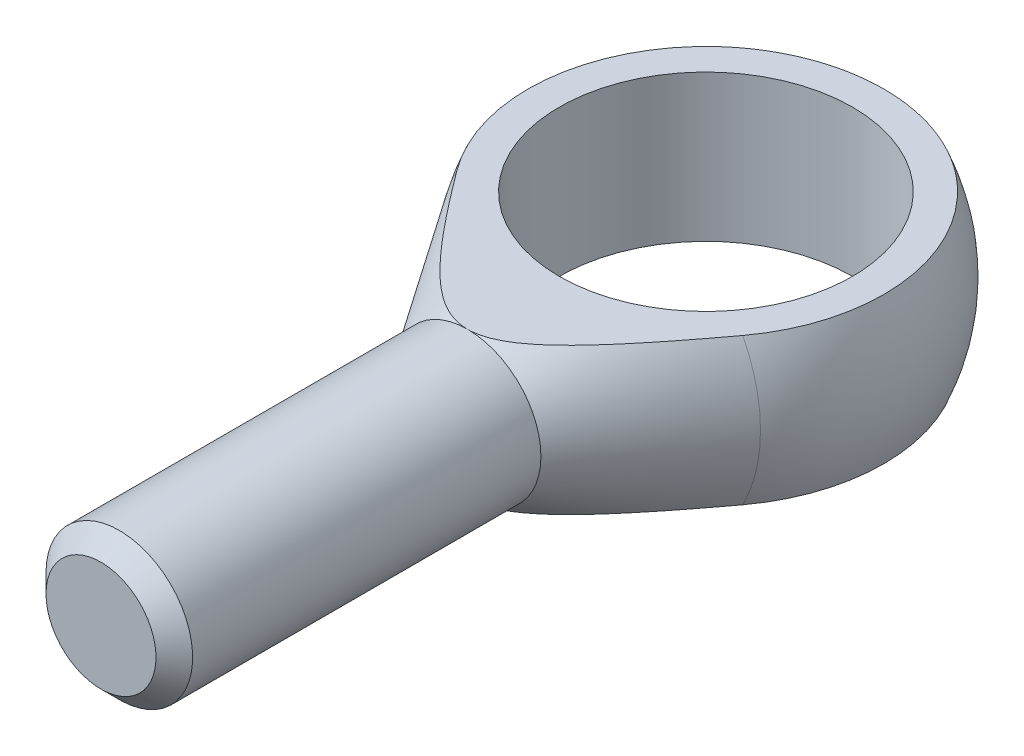
ISO-10303-21;
HEADER;
FILE_DESCRIPTION(('STEP AP214'),'2;1');
FILE_NAME('part.step','',(''),(''),'','','');
FILE_SCHEMA(('AUTOMOTIVE_DESIGN { 1 0 10303 214 1 1 1 1 }'));
ENDSEC;
DATA;
#1=APPLICATION_CONTEXT('core data for automotive mechanical design processes');
#2=APPLICATION_PROTOCOL_DEFINITION('international standard','automotive_design',2000,#1);
#3=PRODUCT_CONTEXT('',#1,'mechanical');
#4=PRODUCT('Part','Part','',(#3));
#5=PRODUCT_RELATED_PRODUCT_CATEGORY('part','',(#4));
#6=PRODUCT_DEFINITION_FORMATION('','',#4);
#7=PRODUCT_DEFINITION_CONTEXT('part definition',#1,'design');
#8=PRODUCT_DEFINITION('design','',#6,#7);
#9=PRODUCT_DEFINITION_SHAPE('','',#8);
#10=(LENGTH_UNIT() NAMED_UNIT(*) SI_UNIT(.MILLI.,.METRE.));
#11=(NAMED_UNIT(*) PLANE_ANGLE_UNIT() SI_UNIT($,.RADIAN.));
#12=(NAMED_UNIT(*) SI_UNIT($,.STERADIAN.) SOLID_ANGLE_UNIT());
#13=UNCERTAINTY_MEASURE_WITH_UNIT(LENGTH_MEASURE(1.E-05),#10,'distance_accuracy_value','');
#14=(GEOMETRIC_REPRESENTATION_CONTEXT(3) GLOBAL_UNCERTAINTY_ASSIGNED_CONTEXT((#13)) GLOBAL_UNIT_ASSIGNED_CONTEXT((#10,
#11,#12)) REPRESENTATION_CONTEXT('',''));
#15=CARTESIAN_POINT('',(0.,0.,0.));
#16=DIRECTION('',(0.,0.,1.));
#17=DIRECTION('',(1.,0.,0.));
#18=AXIS2_PLACEMENT_3D('',#15,#16,#17);
#19=CARTESIAN_POINT('',(0.,0.,26.));
#20=DIRECTION('',(0.,0.,-1.));
#21=DIRECTION('',(-1.,0.,0.));
#22=AXIS2_PLACEMENT_3D('',#19,#20,#21);
#23=CONICAL_SURFACE('',#22,8.,0.583443982313992);
#24=CARTESIAN_POINT('',(0.,0.,11.5689303158746));
#25=DIRECTION('',(0.,0.,-1.));
#26=DIRECTION('',(-1.,0.,0.));
#27=AXIS2_PLACEMENT_3D('',#24,#25,#26);
#28=CIRCLE('',#27,17.5259764734076);
#29=CARTESIAN_POINT('',(-15.5935836595197,-8.,11.5689303158746));
#30=VERTEX_POINT('',#29);
#31=CARTESIAN_POINT('',(-15.5935836595197,8.,11.5689303158746));
#32=VERTEX_POINT('',#31);
#33=EDGE_CURVE('E96',#30,#32,#28,.T.);
#34=ORIENTED_EDGE('',*,*,#33,.F.);
#35=CARTESIAN_POINT('',(-41.7893397113062,-8.,-26.337669903796));
#36=CARTESIAN_POINT('',(-41.1557149048194,-8.,-25.394905966181));
#37=CARTESIAN_POINT('',(-40.5217446952214,-8.,-24.4523741212144));
#38=CARTESIAN_POINT('',(-39.2529967304389,-8.,-22.5678533742964));
#39=CARTESIAN_POINT('',(-38.618218974807,-8.,-21.6258644726461));
#40=CARTESIAN_POINT('',(-36.71236789742,-8.,-18.8006355634881));
#41=CARTESIAN_POINT('',(-35.4399088161728,-8.,-16.9183299344262));
#42=CARTESIAN_POINT('',(-32.8858967777199,-8.,-13.1510921420859));
#43=CARTESIAN_POINT('',(-31.6043277485039,-8.,-11.2661708644965));
#44=CARTESIAN_POINT('',(-29.6766484690636,-8.,-8.44255526329719));
#45=CARTESIAN_POINT('',(-29.033231689383,-8.,-7.50202224300151));
#46=CARTESIAN_POINT('',(-27.7442089664126,-8.,-5.62245895299214));
#47=CARTESIAN_POINT('',(-27.0986030262145,-8.,-4.68342868115889));
#48=CARTESIAN_POINT('',(-25.7984650944112,-8.,-2.7981615987806));
#49=CARTESIAN_POINT('',(-25.1439070952088,-8.,-1.85194271580022));
#50=CARTESIAN_POINT('',(-23.8313788922483,-8.,0.0381249766633964));
#51=CARTESIAN_POINT('',(-23.1734086929347,-8.,0.981973789231412));
#52=CARTESIAN_POINT('',(-21.8529337576566,-8.,2.86691961563203));
#53=CARTESIAN_POINT('',(-21.1904277190853,-8.,3.80801571780575));
#54=CARTESIAN_POINT('',(-19.8597915373833,-8.,5.68619961889504));
#55=CARTESIAN_POINT('',(-19.1916615021039,-8.,6.62328749415891));
#56=CARTESIAN_POINT('',(-17.8490377414385,-8.,8.49051631845942));
#57=CARTESIAN_POINT('',(-17.1745566185374,-8.,9.42066630484811));
#58=CARTESIAN_POINT('',(-16.1550745456963,-8.,10.8102608695757));
#59=CARTESIAN_POINT('',(-15.8139386012655,-8.,11.2725408824194));
#60=CARTESIAN_POINT('',(-15.1285799337566,-8.,12.1948069144964));
#61=CARTESIAN_POINT('',(-14.7843572214204,-8.,12.6547929417041));
#62=CARTESIAN_POINT('',(-14.0923747580127,-8.,13.5717418107129));
#63=CARTESIAN_POINT('',(-13.7446168443339,-8.,14.0287060377496));
#64=CARTESIAN_POINT('',(-13.0445907078003,-8.,14.9391654201993));
#65=CARTESIAN_POINT('',(-12.6923225285202,-8.,15.3926606090601));
#66=CARTESIAN_POINT('',(-11.9822609691241,-8.,16.2952051774635));
#67=CARTESIAN_POINT('',(-11.6244683870814,-8.,16.7442551840711));
#68=CARTESIAN_POINT('',(-10.9019009711095,-8.,17.6366931011255));
#69=CARTESIAN_POINT('',(-10.5371264612838,-8.,18.0800812728114));
#70=CARTESIAN_POINT('',(-10.0453269965719,-8.,18.6655983345714));
#71=CARTESIAN_POINT('',(-9.92228865482356,-8.,18.8110804538051));
#72=CARTESIAN_POINT('',(-9.67512545946615,-8.,19.1011245077806));
#73=CARTESIAN_POINT('',(-9.55100058449968,-8.,19.2456864243375));
#74=CARTESIAN_POINT('',(-9.30156002344154,-8.,19.5337955344612));
#75=CARTESIAN_POINT('',(-9.17624426489803,-8.,19.677342665351));
#76=CARTESIAN_POINT('',(-8.92431499672733,-8.,19.9632920604024));
#77=CARTESIAN_POINT('',(-8.79770149101735,-8.,20.1056943280174));
#78=CARTESIAN_POINT('',(-8.41504916012535,-8.,20.5317407790535));
#79=CARTESIAN_POINT('',(-8.15685724743617,-8.,20.8134608639338));
#80=CARTESIAN_POINT('',(-7.63352118646919,-8.,21.3703563931461));
#81=CARTESIAN_POINT('',(-7.36837750568537,-8.,21.6455322752029));
#82=CARTESIAN_POINT('',(-6.82265047469856,-8.,22.194262460371));
#83=CARTESIAN_POINT('',(-6.54184597688306,-8.,22.4675977243717));
#84=CARTESIAN_POINT('',(-5.96877991117981,-8.,23.0023740909599));
#85=CARTESIAN_POINT('',(-5.6765136245208,-8.,23.2638101969509));
#86=CARTESIAN_POINT('',(-5.22779910687375,-8.,23.6429870211736));
#87=CARTESIAN_POINT('',(-5.07670513469256,-8.,23.7670682966121));
#88=CARTESIAN_POINT('',(-4.77052383447761,-8.,24.0101890400232));
#89=CARTESIAN_POINT('',(-4.61543695116889,-8.,24.1292290656108));
#90=CARTESIAN_POINT('',(-4.30091121552167,-8.,24.3611709536904));
#91=CARTESIAN_POINT('',(-4.14147589954388,-8.,24.4740775929998));
#92=CARTESIAN_POINT('',(-3.81767218441554,-8.,24.6925543289047));
#93=CARTESIAN_POINT('',(-3.65330476387961,-8.,24.7981258673071));
#94=CARTESIAN_POINT('',(-3.33134243037947,-8.,24.9929764293246));
#95=CARTESIAN_POINT('',(-3.17412865893547,-8.,25.0828821963727));
#96=CARTESIAN_POINT('',(-2.85474077312491,-8.,25.253487389059));
#97=CARTESIAN_POINT('',(-2.69256651220986,-8.,25.3341865423711));
#98=CARTESIAN_POINT('',(-2.36335395977583,-8.,25.4844516330758));
#99=CARTESIAN_POINT('',(-2.19632224838547,-8.,25.5540318717474));
#100=CARTESIAN_POINT('',(-1.85740960386001,-8.,25.680121662853));
#101=CARTESIAN_POINT('',(-1.68553055556196,-8.,25.7366362192176));
#102=CARTESIAN_POINT('',(-1.36237703270374,-8.,25.8275233153272));
#103=CARTESIAN_POINT('',(-1.21167023381903,-8.,25.8639063663816));
#104=CARTESIAN_POINT('',(-0.9077943549243,-8.,25.9243557327484));
#105=CARTESIAN_POINT('',(-0.754625537518869,-8.,25.948423352779));
#106=CARTESIAN_POINT('',(-0.446871147442258,-8.,25.9833312715307));
#107=CARTESIAN_POINT('',(-0.2922865340359,-8.,25.9941799423972));
#108=CARTESIAN_POINT('',(0.017243593059444,-8.,26.0022390275379));
#109=CARTESIAN_POINT('',(0.172189110252937,-8.,25.9994493088218));
#110=CARTESIAN_POINT('',(0.481119496647998,-8.,25.9803533180131));
#111=CARTESIAN_POINT('',(0.635104996521218,-8.,25.9640571356025));
#112=CARTESIAN_POINT('',(0.941147894900533,-8.,25.9186042646396));
#113=CARTESIAN_POINT('',(1.09320525868139,-8.,25.8894473448063));
#114=CARTESIAN_POINT('',(1.39462211112206,-8.,25.8192945419706));
#115=CARTESIAN_POINT('',(1.54398017684953,-8.,25.778292597782));
#116=CARTESIAN_POINT('',(1.83936434374538,-8.,25.6857181652654));
#117=CARTESIAN_POINT('',(1.98539004514737,-8.,25.6341444160245));
#118=CARTESIAN_POINT('',(2.37334785538949,-8.,25.482957652231));
#119=CARTESIAN_POINT('',(2.61194225836789,-8.,25.3747496800453));
#120=CARTESIAN_POINT('',(3.07871304264103,-8.,25.1378138107562));
#121=CARTESIAN_POINT('',(3.30688082819653,-8.,25.0090693623793));
#122=CARTESIAN_POINT('',(3.75460909156237,-8.,24.7352391664537));
#123=CARTESIAN_POINT('',(3.97412329515662,-8.,24.590078363952));
#124=CARTESIAN_POINT('',(4.29685928466906,-8.,24.3632590449313));
#125=CARTESIAN_POINT('',(4.40333297776572,-8.,24.2861520457739));
#126=CARTESIAN_POINT('',(4.61428006071462,-8.,24.1292481111753));
#127=CARTESIAN_POINT('',(4.71875347899604,-8.,24.0494512140091));
#128=CARTESIAN_POINT('',(5.01599602551024,-8.,23.8169891709865));
#129=CARTESIAN_POINT('',(5.20645303336845,-8.,23.661364649537));
#130=CARTESIAN_POINT('',(5.58177782763677,-8.,23.3434920456619));
#131=CARTESIAN_POINT('',(5.76664460877452,-8.,23.1812427841153));
#132=CARTESIAN_POINT('',(6.13163792982774,-8.,22.8512912982533));
#133=CARTESIAN_POINT('',(6.31176150305143,-8.,22.6835858012784));
#134=CARTESIAN_POINT('',(6.6678153780134,-8.,22.3437701591296));
#135=CARTESIAN_POINT('',(6.84374539269315,-8.,22.1716597140898));
#136=CARTESIAN_POINT('',(7.19239026527735,-8.,21.823357240046));
#137=CARTESIAN_POINT('',(7.36509598402218,-8.,21.6471560814312));
#138=CARTESIAN_POINT('',(7.70730993896773,-8.,21.2916715681948));
#139=CARTESIAN_POINT('',(7.87681806983155,-8.,21.1123881124048));
#140=CARTESIAN_POINT('',(8.38103102730631,-8.,20.570779100684));
#141=CARTESIAN_POINT('',(8.71155686515788,-8.,20.2045611594055));
#142=CARTESIAN_POINT('',(9.36696230830657,-8.,19.4610833670985));
#143=CARTESIAN_POINT('',(9.69176086119772,-8.,19.083752516552));
#144=CARTESIAN_POINT('',(10.3343867706041,-8.,18.3231671296867));
#145=CARTESIAN_POINT('',(10.6522136230684,-8.,17.9399121684498));
#146=CARTESIAN_POINT('',(11.2817141552758,-8.,17.1694624759606));
#147=CARTESIAN_POINT('',(11.5933972568266,-8.,16.7822754262249));
#148=CARTESIAN_POINT('',(12.0574777532771,-8.,16.1987731967306));
#149=CARTESIAN_POINT('',(12.2115949032139,-8.,16.0038218367269));
#150=CARTESIAN_POINT('',(12.5187851806359,-8.,15.6130984378208));
#151=CARTESIAN_POINT('',(12.6718583089522,-8.,15.4173263995719));
#152=CARTESIAN_POINT('',(13.1608086446923,-8.,14.7888649640009));
#153=CARTESIAN_POINT('',(13.4948591455196,-8.,14.3547536082084));
#154=CARTESIAN_POINT('',(14.1591833346824,-8.,13.4836481710026));
#155=CARTESIAN_POINT('',(14.4894569800663,-8.,13.0466540568947));
#156=CARTESIAN_POINT('',(15.1468695054673,-8.,12.1702894039626));
#157=CARTESIAN_POINT('',(15.4740082642428,-8.,11.7309187742466));
#158=CARTESIAN_POINT('',(16.1256342829024,-8.,10.8502147177181));
#159=CARTESIAN_POINT('',(16.4501215318242,-8.,10.4088812828022));
#160=CARTESIAN_POINT('',(17.4203159238502,-8.,9.08229630095648));
#161=CARTESIAN_POINT('',(18.0626615174788,-8.,8.19458617130412));
#162=CARTESIAN_POINT('',(19.3407385593065,-8.,6.41441777093976));
#163=CARTESIAN_POINT('',(19.9764699547765,-8.,5.52195946246024));
#164=CARTESIAN_POINT('',(21.2436892097622,-8.,3.73232190124357));
#165=CARTESIAN_POINT('',(21.8751705950962,-8.,2.83513806753905));
#166=CARTESIAN_POINT('',(23.1341862593397,-8.,1.03800127547844));
#167=CARTESIAN_POINT('',(23.7617205196844,-8.,0.138048304127656));
#168=CARTESIAN_POINT('',(25.0135896024525,-8.,-1.66395391791588));
#169=CARTESIAN_POINT('',(25.6379247194812,-8.,-2.56600296404517));
#170=CARTESIAN_POINT('',(26.884052891512,-8.,-4.37185503861865));
#171=CARTESIAN_POINT('',(27.505845945233,-8.,-5.27565806794637));
#172=CARTESIAN_POINT('',(29.2759214171934,-8.,-7.85485794708336));
#173=CARTESIAN_POINT('',(30.4216893880862,-8.,-9.53198026409849));
#174=CARTESIAN_POINT('',(32.7082005475804,-8.,-12.8897134135342));
#175=CARTESIAN_POINT('',(33.8489435911886,-8.,-14.5703243445859));
#176=CARTESIAN_POINT('',(36.1245857153204,-8.,-17.9310043169582));
#177=CARTESIAN_POINT('',(37.2594916763625,-8.,-19.6110687004831));
#178=CARTESIAN_POINT('',(38.9596924002792,-8.,-22.1325794836291));
#179=CARTESIAN_POINT('',(39.5260569796141,-8.,-22.9733049475566));
#180=CARTESIAN_POINT('',(40.6581530556589,-8.,-24.6551816601679));
#181=CARTESIAN_POINT('',(41.223884552559,-8.,-25.4963329087237));
#182=CARTESIAN_POINT('',(41.7893397113062,-8.,-26.3376699037959));
#183=B_SPLINE_CURVE_WITH_KNOTS('',3,(#35,#36,#37,#38,#39,#40,#41,#42,#43,#44,#45,#46,#47,#48,
#49,#50,#51,#52,#53,#54,#55,#56,#57,#58,#59,#60,#61,#62,#63,#64,#65,#66,#67,#68,#69,#70,#71,#72,
#73,#74,#75,#76,#77,#78,#79,#80,#81,#82,#83,#84,#85,#86,#87,#88,#89,#90,#91,#92,#93,#94,#95,#96,
#97,#98,#99,#100,#101,#102,#103,#104,#105,#106,#107,#108,#109,#110,#111,#112,#113,#114,#115,
#116,#117,#118,#119,#120,#121,#122,#123,#124,#125,#126,#127,#128,#129,#130,#131,#132,#133,#134,
#135,#136,#137,#138,#139,#140,#141,#142,#143,#144,#145,#146,#147,#148,#149,#150,#151,#152,#153,
#154,#155,#156,#157,#158,#159,#160,#161,#162,#163,#164,#165,#166,#167,#168,#169,#170,#171,#172,
#173,#174,#175,#176,#177,#178,#179,#180,#181,#182),.UNSPECIFIED.,.F.,.F.,(4,2,2,2,2,2,2,2,2,2,2,
2,2,2,2,2,2,2,2,2,2,2,2,2,2,2,2,2,2,2,2,2,2,2,2,2,2,2,2,2,2,2,2,2,2,2,2,2,2,2,2,2,2,2,2,2,2,2,2,
2,2,2,2,2,2,2,2,2,2,2,2,2,2,4),(0.,3.40772031445457,6.81544251742736,13.6315973726992,
20.469575344042,23.8882404822343,27.3069007942674,30.7585592613717,34.2102132336201,
37.6629039219994,41.1155285483487,44.5623424381296,46.2859011427508,48.0094538517592,
49.7321524175262,51.4548343524362,53.1772697092747,54.8996253030469,55.4712253702205,
56.042836698383,56.6144830281691,57.1861276329635,58.3324420856408,59.4786796474449,
60.6540550389304,61.8299195148678,62.4163767003356,63.002768847175,63.5886975509105,
64.1745107551842,64.7175725017291,65.2606503075559,65.8030238781542,66.345189383677,
66.8098370899034,67.2744355603417,67.7387396268031,68.2030482207791,68.6670102763717,
69.1309806759682,69.5951889144585,70.0594525519157,70.844015410507,71.6292138085734,
72.4181594872099,72.8125119792112,73.2068588622576,73.944512882573,74.6822987733587,
75.4205356577836,76.1588229319035,76.8989562316257,77.6391138708417,79.1188647471267,
80.6123716930422,82.105986265329,83.5970969940853,84.3426296310782,85.0881616745519,
86.7314168572388,88.3746907089671,90.0180278598085,91.6613718014572,94.9485318377912,
98.2357180597637,101.527112369136,104.8185221476,108.10962317107,111.400725852797,
117.494126364826,123.587701563831,129.670102454631,132.711202920313,135.75230247217),.UNSPECIFIED.);
#184=CARTESIAN_POINT('',(0.,-8.00000000000001,26.));
#185=VERTEX_POINT('',#184);
#186=EDGE_CURVE('E92',#30,#185,#183,.T.);
#187=ORIENTED_EDGE('',*,*,#186,.T.);
#188=CARTESIAN_POINT('',(0.,0.,26.));
#189=DIRECTION('',(0.,0.,-1.));
#190=DIRECTION('',(-1.,0.,0.));
#191=AXIS2_PLACEMENT_3D('',#188,#189,#190);
#192=CIRCLE('',#191,8.);
#193=CARTESIAN_POINT('',(0.,8.00000000000001,26.));
#194=VERTEX_POINT('',#193);
#195=EDGE_CURVE('E91',#185,#194,#192,.T.);
#196=ORIENTED_EDGE('',*,*,#195,.T.);
#197=CARTESIAN_POINT('',(41.7893397113062,8.,-26.3376699037959));
#198=CARTESIAN_POINT('',(41.1557149048194,8.,-25.394905966181));
#199=CARTESIAN_POINT('',(40.5217446952214,8.,-24.4523741212144));
#200=CARTESIAN_POINT('',(39.2529967304389,8.,-22.5678533742964));
#201=CARTESIAN_POINT('',(38.618218974807,8.,-21.6258644726461));
#202=CARTESIAN_POINT('',(36.71236789742,8.,-18.8006355634881));
#203=CARTESIAN_POINT('',(35.4399088161728,8.,-16.9183299344262));
#204=CARTESIAN_POINT('',(32.88589677772,8.,-13.1510921420859));
#205=CARTESIAN_POINT('',(31.6043277485039,8.,-11.2661708644966));
#206=CARTESIAN_POINT('',(29.6766484690636,8.,-8.44255526329724));
#207=CARTESIAN_POINT('',(29.0332316893831,8.,-7.50202224300156));
#208=CARTESIAN_POINT('',(27.7442089664127,8.,-5.6224589529922));
#209=CARTESIAN_POINT('',(27.0986030262145,8.,-4.68342868115895));
#210=CARTESIAN_POINT('',(25.7984650944112,8.,-2.79816159878066));
#211=CARTESIAN_POINT('',(25.1439070952088,8.,-1.85194271580028));
#212=CARTESIAN_POINT('',(23.8313788922483,8.,0.0381249766633464));
#213=CARTESIAN_POINT('',(23.1734086929347,8.,0.981973789231365));
#214=CARTESIAN_POINT('',(21.8529337576566,8.,2.86691961563199));
#215=CARTESIAN_POINT('',(21.1904277190853,8.,3.80801571780572));
#216=CARTESIAN_POINT('',(19.8597915373833,8.,5.686199618895));
#217=CARTESIAN_POINT('',(19.1916615021039,8.,6.62328749415887));
#218=CARTESIAN_POINT('',(17.8490377414385,8.,8.49051631845939));
#219=CARTESIAN_POINT('',(17.1745566185374,8.,9.42066630484808));
#220=CARTESIAN_POINT('',(16.1550745456963,8.,10.8102608695756));
#221=CARTESIAN_POINT('',(15.8139386012655,8.,11.2725408824194));
#222=CARTESIAN_POINT('',(15.1285799337566,8.,12.1948069144964));
#223=CARTESIAN_POINT('',(14.7843572214204,8.,12.6547929417041));
#224=CARTESIAN_POINT('',(14.0923747580127,8.,13.5717418107129));
#225=CARTESIAN_POINT('',(13.7446168443339,8.,14.0287060377496));
#226=CARTESIAN_POINT('',(13.0445907078003,8.,14.9391654201993));
#227=CARTESIAN_POINT('',(12.6923225285202,8.,15.3926606090601));
#228=CARTESIAN_POINT('',(11.9822609691241,8.,16.2952051774635));
#229=CARTESIAN_POINT('',(11.6244683870814,8.,16.7442551840711));
#230=CARTESIAN_POINT('',(10.9019009711095,8.,17.6366931011255));
#231=CARTESIAN_POINT('',(10.5371264612838,8.,18.0800812728114));
#232=CARTESIAN_POINT('',(10.0453269965719,8.,18.6655983345714));
#233=CARTESIAN_POINT('',(9.92228865482356,8.,18.8110804538051));
#234=CARTESIAN_POINT('',(9.67512545946615,8.,19.1011245077806));
#235=CARTESIAN_POINT('',(9.55100058449968,8.,19.2456864243375));
#236=CARTESIAN_POINT('',(9.30156002344154,8.,19.5337955344612));
#237=CARTESIAN_POINT('',(9.17624426489803,8.,19.677342665351));
#238=CARTESIAN_POINT('',(8.92431499672733,8.,19.9632920604024));
#239=CARTESIAN_POINT('',(8.79770149101735,8.,20.1056943280174));
#240=CARTESIAN_POINT('',(8.41504916012535,8.,20.5317407790535));
#241=CARTESIAN_POINT('',(8.15685724743617,8.,20.8134608639338));
#242=CARTESIAN_POINT('',(7.63352118646919,8.,21.3703563931461));
#243=CARTESIAN_POINT('',(7.36837750568537,8.,21.6455322752029));
#244=CARTESIAN_POINT('',(6.82265047469856,8.,22.194262460371));
#245=CARTESIAN_POINT('',(6.54184597688306,8.,22.4675977243717));
#246=CARTESIAN_POINT('',(5.96877991117981,8.,23.0023740909599));
#247=CARTESIAN_POINT('',(5.6765136245208,8.,23.2638101969509));
#248=CARTESIAN_POINT('',(5.22779910687375,8.,23.6429870211736));
#249=CARTESIAN_POINT('',(5.07670513469256,8.,23.7670682966121));
#250=CARTESIAN_POINT('',(4.77052383447761,8.,24.0101890400232));
#251=CARTESIAN_POINT('',(4.61543695116889,8.,24.1292290656108));
#252=CARTESIAN_POINT('',(4.30091121552167,8.,24.3611709536904));
#253=CARTESIAN_POINT('',(4.14147589954387,8.,24.4740775929999));
#254=CARTESIAN_POINT('',(3.81767218441553,8.,24.6925543289047));
#255=CARTESIAN_POINT('',(3.65330476387961,8.,24.7981258673071));
#256=CARTESIAN_POINT('',(3.33134243037946,8.,24.9929764293246));
#257=CARTESIAN_POINT('',(3.17412865893546,8.,25.0828821963727));
#258=CARTESIAN_POINT('',(2.85474077312491,8.,25.253487389059));
#259=CARTESIAN_POINT('',(2.69256651220985,8.,25.3341865423711));
#260=CARTESIAN_POINT('',(2.36335395977583,8.,25.4844516330758));
#261=CARTESIAN_POINT('',(2.19632224838547,8.,25.5540318717474));
#262=CARTESIAN_POINT('',(1.85740960386001,8.,25.680121662853));
#263=CARTESIAN_POINT('',(1.68553055556195,8.,25.7366362192176));
#264=CARTESIAN_POINT('',(1.36237703270374,8.,25.8275233153272));
#265=CARTESIAN_POINT('',(1.21167023381903,8.,25.8639063663816));
#266=CARTESIAN_POINT('',(0.907794354924299,8.,25.9243557327484));
#267=CARTESIAN_POINT('',(0.754625537518868,8.,25.948423352779));
#268=CARTESIAN_POINT('',(0.446871147442256,8.,25.9833312715307));
#269=CARTESIAN_POINT('',(0.292286534035899,8.,25.9941799423972));
#270=CARTESIAN_POINT('',(-0.0172435930594455,8.,26.0022390275379));
#271=CARTESIAN_POINT('',(-0.172189110252938,8.,25.9994493088218));
#272=CARTESIAN_POINT('',(-0.481119496648,8.,25.9803533180131));
#273=CARTESIAN_POINT('',(-0.63510499652122,8.,25.9640571356025));
#274=CARTESIAN_POINT('',(-0.941147894900534,8.,25.9186042646396));
#275=CARTESIAN_POINT('',(-1.09320525868139,8.,25.8894473448063));
#276=CARTESIAN_POINT('',(-1.39462211112206,8.,25.8192945419706));
#277=CARTESIAN_POINT('',(-1.54398017684953,8.,25.778292597782));
#278=CARTESIAN_POINT('',(-1.83936434374538,8.,25.6857181652654));
#279=CARTESIAN_POINT('',(-1.98539004514737,8.,25.6341444160245));
#280=CARTESIAN_POINT('',(-2.37334785538949,8.,25.482957652231));
#281=CARTESIAN_POINT('',(-2.6119422583679,8.,25.3747496800453));
#282=CARTESIAN_POINT('',(-3.07871304264103,8.,25.1378138107562));
#283=CARTESIAN_POINT('',(-3.30688082819653,8.,25.0090693623793));
#284=CARTESIAN_POINT('',(-3.75460909156237,8.,24.7352391664537));
#285=CARTESIAN_POINT('',(-3.97412329515662,8.,24.590078363952));
#286=CARTESIAN_POINT('',(-4.29685928466906,8.,24.3632590449313));
#287=CARTESIAN_POINT('',(-4.40333297776573,8.,24.2861520457739));
#288=CARTESIAN_POINT('',(-4.61428006071463,8.,24.1292481111753));
#289=CARTESIAN_POINT('',(-4.71875347899605,8.,24.0494512140091));
#290=CARTESIAN_POINT('',(-5.01599602551024,8.,23.8169891709865));
#291=CARTESIAN_POINT('',(-5.20645303336846,8.,23.661364649537));
#292=CARTESIAN_POINT('',(-5.58177782763677,8.,23.3434920456619));
#293=CARTESIAN_POINT('',(-5.76664460877452,8.,23.1812427841153));
#294=CARTESIAN_POINT('',(-6.13163792982773,8.,22.8512912982533));
#295=CARTESIAN_POINT('',(-6.31176150305142,8.,22.6835858012784));
#296=CARTESIAN_POINT('',(-6.6678153780134,8.,22.3437701591296));
#297=CARTESIAN_POINT('',(-6.84374539269315,8.,22.1716597140898));
#298=CARTESIAN_POINT('',(-7.19239026527734,8.,21.823357240046));
#299=CARTESIAN_POINT('',(-7.36509598402218,8.,21.6471560814312));
#300=CARTESIAN_POINT('',(-7.70730993896774,8.,21.2916715681947));
#301=CARTESIAN_POINT('',(-7.87681806983155,8.,21.1123881124048));
#302=CARTESIAN_POINT('',(-8.38103102730632,8.,20.5707791006839));
#303=CARTESIAN_POINT('',(-8.71155686515789,8.,20.2045611594055));
#304=CARTESIAN_POINT('',(-9.36696230830658,8.,19.4610833670985));
#305=CARTESIAN_POINT('',(-9.69176086119773,8.,19.0837525165519));
#306=CARTESIAN_POINT('',(-10.3343867706041,8.,18.3231671296867));
#307=CARTESIAN_POINT('',(-10.6522136230684,8.,17.9399121684498));
#308=CARTESIAN_POINT('',(-11.2817141552758,8.,17.1694624759606));
#309=CARTESIAN_POINT('',(-11.5933972568266,8.,16.7822754262249));
#310=CARTESIAN_POINT('',(-12.0574777532771,8.,16.1987731967306));
#311=CARTESIAN_POINT('',(-12.2115949032139,8.,16.0038218367269));
#312=CARTESIAN_POINT('',(-12.5187851806359,8.,15.6130984378208));
#313=CARTESIAN_POINT('',(-12.6718583089523,8.,15.4173263995719));
#314=CARTESIAN_POINT('',(-13.1608086446924,8.,14.7888649640009));
#315=CARTESIAN_POINT('',(-13.4948591455197,8.,14.3547536082084));
#316=CARTESIAN_POINT('',(-14.1591833346824,8.,13.4836481710026));
#317=CARTESIAN_POINT('',(-14.4894569800663,8.,13.0466540568947));
#318=CARTESIAN_POINT('',(-15.1468695054673,8.,12.1702894039626));
#319=CARTESIAN_POINT('',(-15.4740082642428,8.,11.7309187742466));
#320=CARTESIAN_POINT('',(-16.1256342829024,8.,10.8502147177181));
#321=CARTESIAN_POINT('',(-16.4501215318242,8.,10.4088812828021));
#322=CARTESIAN_POINT('',(-17.4203159238503,8.,9.08229630095646));
#323=CARTESIAN_POINT('',(-18.0626615174788,8.,8.1945861713041));
#324=CARTESIAN_POINT('',(-19.3407385593065,8.,6.41441777093975));
#325=CARTESIAN_POINT('',(-19.9764699547765,8.,5.52195946246022));
#326=CARTESIAN_POINT('',(-21.2436892097622,8.,3.73232190124355));
#327=CARTESIAN_POINT('',(-21.8751705950962,8.,2.83513806753903));
#328=CARTESIAN_POINT('',(-23.1341862593397,8.,1.03800127547841));
#329=CARTESIAN_POINT('',(-23.7617205196844,8.,0.13804830412763));
#330=CARTESIAN_POINT('',(-25.0135896024525,8.,-1.66395391791591));
#331=CARTESIAN_POINT('',(-25.6379247194812,8.,-2.56600296404521));
#332=CARTESIAN_POINT('',(-26.884052891512,8.,-4.37185503861868));
#333=CARTESIAN_POINT('',(-27.5058459452331,8.,-5.2756580679464));
#334=CARTESIAN_POINT('',(-29.2759214171934,8.,-7.85485794708338));
#335=CARTESIAN_POINT('',(-30.4216893880862,8.,-9.5319802640985));
#336=CARTESIAN_POINT('',(-32.7082005475804,8.,-12.8897134135342));
#337=CARTESIAN_POINT('',(-33.8489435911886,8.,-14.5703243445859));
#338=CARTESIAN_POINT('',(-36.1245857153204,8.,-17.9310043169582));
#339=CARTESIAN_POINT('',(-37.2594916763625,8.,-19.6110687004831));
#340=CARTESIAN_POINT('',(-38.9596924002792,8.,-22.1325794836291));
#341=CARTESIAN_POINT('',(-39.5260569796141,8.,-22.9733049475566));
#342=CARTESIAN_POINT('',(-40.6581530556589,8.,-24.6551816601679));
#343=CARTESIAN_POINT('',(-41.223884552559,8.,-25.4963329087237));
#344=CARTESIAN_POINT('',(-41.7893397113062,8.,-26.3376699037959));
#345=B_SPLINE_CURVE_WITH_KNOTS('',3,(#197,#198,#199,#200,#201,#202,#203,#204,#205,#206,#207,
#208,#209,#210,#211,#212,#213,#214,#215,#216,#217,#218,#219,#220,#221,#222,#223,#224,#225,#226,
#227,#228,#229,#230,#231,#232,#233,#234,#235,#236,#237,#238,#239,#240,#241,#242,#243,#244,#245,
#246,#247,#248,#249,#250,#251,#252,#253,#254,#255,#256,#257,#258,#259,#260,#261,#262,#263,#264,
#265,#266,#267,#268,#269,#270,#271,#272,#273,#274,#275,#276,#277,#278,#279,#280,#281,#282,#283,
#284,#285,#286,#287,#288,#289,#290,#291,#292,#293,#294,#295,#296,#297,#298,#299,#300,#301,#302,
#303,#304,#305,#306,#307,#308,#309,#310,#311,#312,#313,#314,#315,#316,#317,#318,#319,#320,#321,
#322,#323,#324,#325,#326,#327,#328,#329,#330,#331,#332,#333,#334,#335,#336,#337,#338,#339,#340,
#341,#342,#343,#344),.UNSPECIFIED.,.F.,.F.,(4,2,2,2,2,2,2,2,2,2,2,2,2,2,2,2,2,2,2,2,2,2,2,2,2,2,
2,2,2,2,2,2,2,2,2,2,2,2,2,2,2,2,2,2,2,2,2,2,2,2,2,2,2,2,2,2,2,2,2,2,2,2,2,2,2,2,2,2,2,2,2,2,2,
4),(0.,3.40772031445456,6.81544251742734,13.6315973726992,20.4695753440419,23.8882404822342,
27.3069007942673,30.7585592613717,34.21021323362,37.6629039219994,41.1155285483487,
44.5623424381295,46.2859011427508,48.0094538517591,49.7321524175262,51.4548343524362,
53.1772697092746,54.8996253030469,55.4712253702205,56.042836698383,56.614483028169,
57.1861276329635,58.3324420856408,59.4786796474449,60.6540550389304,61.8299195148678,
62.4163767003356,63.0027688471749,63.5886975509105,64.1745107551842,64.7175725017291,
65.2606503075558,65.8030238781542,66.3451893836769,66.8098370899034,67.2744355603416,
67.7387396268031,68.2030482207791,68.6670102763717,69.1309806759682,69.5951889144585,
70.0594525519157,70.844015410507,71.6292138085734,72.4181594872099,72.8125119792112,
73.2068588622576,73.944512882573,74.6822987733587,75.4205356577836,76.1588229319035,
76.8989562316257,77.6391138708417,79.1188647471267,80.6123716930422,82.105986265329,
83.5970969940853,84.3426296310782,85.0881616745519,86.7314168572388,88.3746907089671,
90.0180278598085,91.6613718014572,94.9485318377912,98.2357180597637,101.527112369136,
104.8185221476,108.10962317107,111.400725852797,117.494126364826,123.587701563831,
129.670102454631,132.711202920313,135.75230247217),.UNSPECIFIED.);
#346=EDGE_CURVE('E71',#194,#32,#345,.T.);
#347=ORIENTED_EDGE('',*,*,#346,.T.);
#348=EDGE_LOOP('',(#34,#187,#196,#347));
#349=FACE_BOUND('',#348,.T.);
#350=ADVANCED_FACE('F36',(#349),#23,.T.);
#351=EDGE_CURVE('E86',#194,#185,#192,.T.);
#352=ORIENTED_EDGE('',*,*,#351,.T.);
#353=CARTESIAN_POINT('',(15.5935836595197,-8.,11.5689303158746));
#354=VERTEX_POINT('',#353);
#355=EDGE_CURVE('E88',#185,#354,#183,.T.);
#356=ORIENTED_EDGE('',*,*,#355,.T.);
#357=CARTESIAN_POINT('',(15.5935836595197,8.,11.5689303158746));
#358=VERTEX_POINT('',#357);
#359=EDGE_CURVE('E87',#358,#354,#28,.T.);
#360=ORIENTED_EDGE('',*,*,#359,.F.);
#361=EDGE_CURVE('E74',#358,#194,#345,.T.);
#362=ORIENTED_EDGE('',*,*,#361,.T.);
#363=EDGE_LOOP('',(#352,#356,#360,#362));
#364=FACE_BOUND('',#363,.T.);
#365=ADVANCED_FACE('F84',(#364),#23,.T.);
#366=CARTESIAN_POINT('',(0.,0.,0.));
#367=DIRECTION('',(0.,0.,-1.));
#368=DIRECTION('',(1.,0.,0.));
#369=AXIS2_PLACEMENT_3D('',#366,#367,#368);
#370=SPHERICAL_SURFACE('',#369,21.);
#371=CARTESIAN_POINT('',(0.,-8.,0.));
#372=DIRECTION('',(0.,1.,0.));
#373=DIRECTION('',(0.,0.,1.));
#374=AXIS2_PLACEMENT_3D('',#371,#372,#373);
#375=CIRCLE('',#374,19.4164878389476);
#376=EDGE_CURVE('E52',#354,#30,#375,.T.);
#377=ORIENTED_EDGE('',*,*,#376,.T.);
#378=ORIENTED_EDGE('',*,*,#33,.T.);
#379=CARTESIAN_POINT('',(0.,8.,0.));
#380=DIRECTION('',(0.,-1.,0.));
#381=DIRECTION('',(0.,0.,-1.));
#382=AXIS2_PLACEMENT_3D('',#379,#380,#381);
#383=CIRCLE('',#382,19.4164878389476);
#384=EDGE_CURVE('E76',#32,#358,#383,.T.);
#385=ORIENTED_EDGE('',*,*,#384,.T.);
#386=ORIENTED_EDGE('',*,*,#359,.T.);
#387=EDGE_LOOP('',(#377,#378,#385,#386));
#388=FACE_BOUND('',#387,.T.);
#389=ADVANCED_FACE('F124',(#388),#370,.T.);
#390=CARTESIAN_POINT('',(0.,0.,66.));
#391=DIRECTION('',(0.,0.,-1.));
#392=DIRECTION('',(-1.,0.,0.));
#393=AXIS2_PLACEMENT_3D('',#390,#391,#392);
#394=PLANE('',#393);
#395=CARTESIAN_POINT('',(0.,0.,66.));
#396=DIRECTION('',(0.,0.,-1.));
#397=DIRECTION('',(-1.,0.,0.));
#398=AXIS2_PLACEMENT_3D('',#395,#396,#397);
#399=CIRCLE('',#398,5.99999999999998);
#400=CARTESIAN_POINT('',(-5.99999999999998,0.,66.));
#401=VERTEX_POINT('',#400);
#402=EDGE_CURVE('E11',#401,#401,#399,.F.);
#403=ORIENTED_EDGE('',*,*,#402,.T.);
#404=EDGE_LOOP('',(#403));
#405=FACE_BOUND('',#404,.T.);
#406=ADVANCED_FACE('F142',(#405),#394,.F.);
#407=CARTESIAN_POINT('',(0.,0.,-26.0435164980697));
#408=DIRECTION('',(0.,0.,-1.));
#409=DIRECTION('',(-1.,0.,0.));
#410=AXIS2_PLACEMENT_3D('',#407,#408,#409);
#411=CYLINDRICAL_SURFACE('',#410,8.00000000000001);
#412=CARTESIAN_POINT('',(0.,0.,64.));
#413=DIRECTION('',(0.,0.,-1.));
#414=DIRECTION('',(-1.,0.,0.));
#415=AXIS2_PLACEMENT_3D('',#412,#413,#414);
#416=CIRCLE('',#415,8.00000000000001);
#417=CARTESIAN_POINT('',(-8.00000000000001,0.,64.));
#418=VERTEX_POINT('',#417);
#419=EDGE_CURVE('E45',#418,#418,#416,.T.);
#420=ORIENTED_EDGE('',*,*,#419,.T.);
#421=EDGE_LOOP('',(#420));
#422=FACE_BOUND('',#421,.T.);
#423=ORIENTED_EDGE('',*,*,#351,.F.);
#424=ORIENTED_EDGE('',*,*,#195,.F.);
#425=EDGE_LOOP('',(#423,#424));
#426=FACE_BOUND('',#425,.T.);
#427=ADVANCED_FACE('F95',(#422,#426),#411,.T.);
#428=CARTESIAN_POINT('',(-21.,8.,26.));
#429=DIRECTION('',(0.,-1.,0.));
#430=DIRECTION('',(0.,0.,-1.));
#431=AXIS2_PLACEMENT_3D('',#428,#429,#430);
#432=PLANE('',#431);
#433=CARTESIAN_POINT('',(0.,8.00000000000001,0.));
#434=DIRECTION('',(0.,1.,0.));
#435=DIRECTION('',(0.,0.,1.));
#436=AXIS2_PLACEMENT_3D('',#433,#434,#435);
#437=CIRCLE('',#436,16.);
#438=CARTESIAN_POINT('',(0.,8.00000000000001,16.));
#439=VERTEX_POINT('',#438);
#440=EDGE_CURVE('E200',#439,#439,#437,.T.);
#441=ORIENTED_EDGE('',*,*,#440,.F.);
#442=EDGE_LOOP('',(#441));
#443=FACE_BOUND('',#442,.T.);
#444=ORIENTED_EDGE('',*,*,#361,.F.);
#445=ORIENTED_EDGE('',*,*,#384,.F.);
#446=ORIENTED_EDGE('',*,*,#346,.F.);
#447=EDGE_LOOP('',(#444,#445,#446));
#448=FACE_BOUND('',#447,.T.);
#449=ADVANCED_FACE('F73',(#443,#448),#432,.F.);
#450=CARTESIAN_POINT('',(-21.,-8.,26.));
#451=DIRECTION('',(0.,1.,0.));
#452=DIRECTION('',(0.,0.,1.));
#453=AXIS2_PLACEMENT_3D('',#450,#451,#452);
#454=PLANE('',#453);
#455=CARTESIAN_POINT('',(0.,-8.00000000000001,0.));
#456=DIRECTION('',(0.,1.,0.));
#457=DIRECTION('',(0.,0.,1.));
#458=AXIS2_PLACEMENT_3D('',#455,#456,#457);
#459=CIRCLE('',#458,16.);
#460=CARTESIAN_POINT('',(0.,-8.00000000000001,16.));
#461=VERTEX_POINT('',#460);
#462=EDGE_CURVE('E80',#461,#461,#459,.T.);
#463=ORIENTED_EDGE('',*,*,#462,.T.);
#464=EDGE_LOOP('',(#463));
#465=FACE_BOUND('',#464,.T.);
#466=ORIENTED_EDGE('',*,*,#186,.F.);
#467=ORIENTED_EDGE('',*,*,#376,.F.);
#468=ORIENTED_EDGE('',*,*,#355,.F.);
#469=EDGE_LOOP('',(#466,#467,#468));
#470=FACE_BOUND('',#469,.T.);
#471=ADVANCED_FACE('F116',(#465,#470),#454,.F.);
#472=CARTESIAN_POINT('',(0.,-8.00000000000001,0.));
#473=DIRECTION('',(0.,1.,0.));
#474=DIRECTION('',(0.,0.,1.));
#475=AXIS2_PLACEMENT_3D('',#472,#473,#474);
#476=CYLINDRICAL_SURFACE('',#475,16.);
#477=ORIENTED_EDGE('',*,*,#462,.F.);
#478=EDGE_LOOP('',(#477));
#479=FACE_BOUND('',#478,.T.);
#480=ORIENTED_EDGE('',*,*,#440,.T.);
#481=EDGE_LOOP('',(#480));
#482=FACE_BOUND('',#481,.T.);
#483=ADVANCED_FACE('F111',(#479,#482),#476,.F.);
#484=CARTESIAN_POINT('',(0.,0.,64.));
#485=DIRECTION('',(0.,0.,-1.));
#486=DIRECTION('',(-1.,0.,0.));
#487=AXIS2_PLACEMENT_3D('',#484,#485,#486);
#488=CONICAL_SURFACE('',#487,8.00000000000001,0.785398163397451);
#489=ORIENTED_EDGE('',*,*,#402,.F.);
#490=EDGE_LOOP('',(#489));
#491=FACE_BOUND('',#490,.T.);
#492=ORIENTED_EDGE('',*,*,#419,.F.);
#493=EDGE_LOOP('',(#492));
#494=FACE_BOUND('',#493,.T.);
#495=ADVANCED_FACE('F39',(#491,#494),#488,.T.);
#496=CLOSED_SHELL('',(#350,#365,#389,#406,#427,#449,#471,#483,#495));
#497=MANIFOLD_SOLID_BREP('B2',#496);
#498=ADVANCED_BREP_SHAPE_REPRESENTATION('',(#18,#497),#14);
#499=SHAPE_DEFINITION_REPRESENTATION(#9,#498);
ENDSEC;
END-ISO-10303-21;
